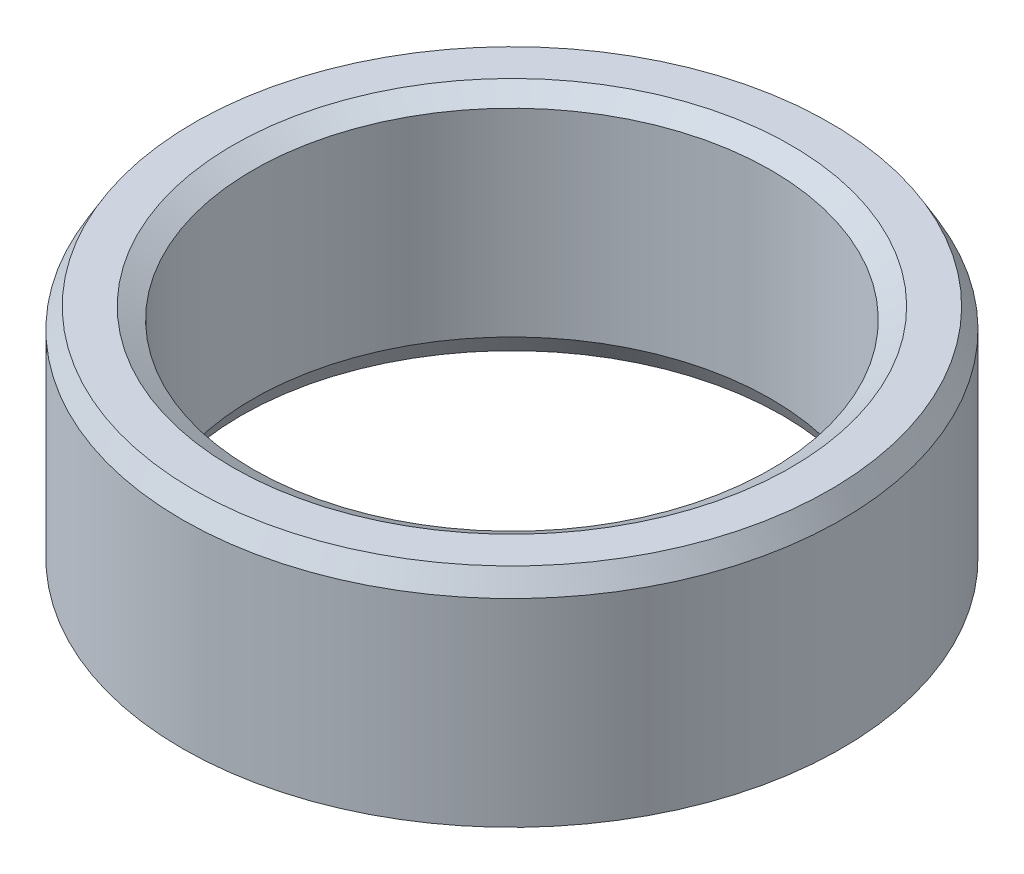
ISO-10303-21;
HEADER;
FILE_DESCRIPTION(('STEP AP214'),'2;1');
FILE_NAME('part.step','',(''),(''),'','','');
FILE_SCHEMA(('AUTOMOTIVE_DESIGN { 1 0 10303 214 1 1 1 1 }'));
ENDSEC;
DATA;
#1=APPLICATION_CONTEXT('core data for automotive mechanical design processes');
#2=APPLICATION_PROTOCOL_DEFINITION('international standard','automotive_design',2000,#1);
#3=PRODUCT_CONTEXT('',#1,'mechanical');
#4=PRODUCT('Part','Part','',(#3));
#5=PRODUCT_RELATED_PRODUCT_CATEGORY('part','',(#4));
#6=PRODUCT_DEFINITION_FORMATION('','',#4);
#7=PRODUCT_DEFINITION_CONTEXT('part definition',#1,'design');
#8=PRODUCT_DEFINITION('design','',#6,#7);
#9=PRODUCT_DEFINITION_SHAPE('','',#8);
#10=(LENGTH_UNIT() NAMED_UNIT(*) SI_UNIT(.MILLI.,.METRE.));
#11=(NAMED_UNIT(*) PLANE_ANGLE_UNIT() SI_UNIT($,.RADIAN.));
#12=(NAMED_UNIT(*) SI_UNIT($,.STERADIAN.) SOLID_ANGLE_UNIT());
#13=UNCERTAINTY_MEASURE_WITH_UNIT(LENGTH_MEASURE(1.E-05),#10,'distance_accuracy_value','');
#14=(GEOMETRIC_REPRESENTATION_CONTEXT(3) GLOBAL_UNCERTAINTY_ASSIGNED_CONTEXT((#13)) GLOBAL_UNIT_ASSIGNED_CONTEXT((#10,
#11,#12)) REPRESENTATION_CONTEXT('',''));
#15=CARTESIAN_POINT('',(0.,0.,0.));
#16=DIRECTION('',(0.,0.,1.));
#17=DIRECTION('',(1.,0.,0.));
#18=AXIS2_PLACEMENT_3D('',#15,#16,#17);
#19=CARTESIAN_POINT('',(0.,24.4000083490833,0.));
#20=DIRECTION('',(0.,-1.,0.));
#21=DIRECTION('',(0.,0.,-1.));
#22=AXIS2_PLACEMENT_3D('',#19,#20,#21);
#23=CYLINDRICAL_SURFACE('',#22,35.);
#24=CARTESIAN_POINT('',(0.,1.22980136216013,0.));
#25=DIRECTION('',(0.,1.,0.));
#26=DIRECTION('',(0.,0.,1.));
#27=AXIS2_PLACEMENT_3D('',#24,#25,#26);
#28=CIRCLE('',#27,35.);
#29=CARTESIAN_POINT('',(0.,1.22980136216013,35.));
#30=VERTEX_POINT('',#29);
#31=EDGE_CURVE('E10',#30,#30,#28,.T.);
#32=ORIENTED_EDGE('',*,*,#31,.T.);
#33=EDGE_LOOP('',(#32));
#34=FACE_BOUND('',#33,.T.);
#35=CARTESIAN_POINT('',(0.,22.2699299066045,0.));
#36=DIRECTION('',(0.,1.,0.));
#37=DIRECTION('',(0.,0.,1.));
#38=AXIS2_PLACEMENT_3D('',#35,#36,#37);
#39=CIRCLE('',#38,35.);
#40=CARTESIAN_POINT('',(0.,22.2699299066045,35.));
#41=VERTEX_POINT('',#40);
#42=EDGE_CURVE('E50',#41,#41,#39,.F.);
#43=ORIENTED_EDGE('',*,*,#42,.T.);
#44=EDGE_LOOP('',(#43));
#45=FACE_BOUND('',#44,.T.);
#46=ADVANCED_FACE('F39',(#34,#45),#23,.T.);
#47=CARTESIAN_POINT('',(0.,24.4000083490833,0.));
#48=DIRECTION('',(0.,1.,0.));
#49=DIRECTION('',(0.,0.,1.));
#50=AXIS2_PLACEMENT_3D('',#47,#48,#49);
#51=PLANE('',#50);
#52=CARTESIAN_POINT('',(0.,24.4000083490833,0.));
#53=DIRECTION('',(0.,1.,0.));
#54=DIRECTION('',(0.,0.,1.));
#55=AXIS2_PLACEMENT_3D('',#52,#53,#54);
#56=CIRCLE('',#55,29.6420088446236);
#57=CARTESIAN_POINT('',(0.,24.4000083490833,29.6420088446236));
#58=VERTEX_POINT('',#57);
#59=EDGE_CURVE('E58',#58,#58,#56,.F.);
#60=ORIENTED_EDGE('',*,*,#59,.T.);
#61=EDGE_LOOP('',(#60));
#62=FACE_BOUND('',#61,.T.);
#63=CARTESIAN_POINT('',(0.,24.4000083490833,0.));
#64=DIRECTION('',(0.,1.,0.));
#65=DIRECTION('',(0.,0.,1.));
#66=AXIS2_PLACEMENT_3D('',#63,#64,#65);
#67=CIRCLE('',#66,33.7701986378399);
#68=CARTESIAN_POINT('',(0.,24.4000083490833,33.7701986378399));
#69=VERTEX_POINT('',#68);
#70=EDGE_CURVE('E61',#69,#69,#67,.T.);
#71=ORIENTED_EDGE('',*,*,#70,.T.);
#72=EDGE_LOOP('',(#71));
#73=FACE_BOUND('',#72,.T.);
#74=ADVANCED_FACE('F88',(#62,#73),#51,.T.);
#75=CARTESIAN_POINT('',(0.,0.,0.));
#76=DIRECTION('',(0.,1.,0.));
#77=DIRECTION('',(0.,0.,1.));
#78=AXIS2_PLACEMENT_3D('',#75,#76,#77);
#79=PLANE('',#78);
#80=CARTESIAN_POINT('',(0.,0.,0.));
#81=DIRECTION('',(0.,1.,0.));
#82=DIRECTION('',(0.,0.,1.));
#83=AXIS2_PLACEMENT_3D('',#80,#81,#82);
#84=CIRCLE('',#83,28.7417317643049);
#85=CARTESIAN_POINT('',(0.,0.,28.7417317643049));
#86=VERTEX_POINT('',#85);
#87=EDGE_CURVE('E51',#86,#86,#84,.T.);
#88=ORIENTED_EDGE('',*,*,#87,.T.);
#89=EDGE_LOOP('',(#88));
#90=FACE_BOUND('',#89,.T.);
#91=CARTESIAN_POINT('',(0.,0.,0.));
#92=DIRECTION('',(0.,1.,0.));
#93=DIRECTION('',(0.,0.,1.));
#94=AXIS2_PLACEMENT_3D('',#91,#92,#93);
#95=CIRCLE('',#94,32.8699215575212);
#96=CARTESIAN_POINT('',(0.,0.,32.8699215575212));
#97=VERTEX_POINT('',#96);
#98=EDGE_CURVE('E54',#97,#97,#95,.F.);
#99=ORIENTED_EDGE('',*,*,#98,.T.);
#100=EDGE_LOOP('',(#99));
#101=FACE_BOUND('',#100,.T.);
#102=ADVANCED_FACE('F83',(#90,#101),#79,.F.);
#103=CARTESIAN_POINT('',(0.,24.4000083490833,0.));
#104=DIRECTION('',(0.,-1.,0.));
#105=DIRECTION('',(0.,0.,-1.));
#106=AXIS2_PLACEMENT_3D('',#103,#104,#105);
#107=CYLINDRICAL_SURFACE('',#106,27.5119304021448);
#108=CARTESIAN_POINT('',(0.,23.1702069869232,0.));
#109=DIRECTION('',(0.,1.,0.));
#110=DIRECTION('',(0.,0.,1.));
#111=AXIS2_PLACEMENT_3D('',#108,#109,#110);
#112=CIRCLE('',#111,27.5119304021448);
#113=CARTESIAN_POINT('',(0.,23.1702069869232,27.5119304021448));
#114=VERTEX_POINT('',#113);
#115=EDGE_CURVE('E67',#114,#114,#112,.T.);
#116=ORIENTED_EDGE('',*,*,#115,.T.);
#117=EDGE_LOOP('',(#116));
#118=FACE_BOUND('',#117,.T.);
#119=CARTESIAN_POINT('',(0.,2.13007844247876,0.));
#120=DIRECTION('',(0.,1.,0.));
#121=DIRECTION('',(0.,0.,1.));
#122=AXIS2_PLACEMENT_3D('',#119,#120,#121);
#123=CIRCLE('',#122,27.5119304021448);
#124=CARTESIAN_POINT('',(0.,2.13007844247876,27.5119304021448));
#125=VERTEX_POINT('',#124);
#126=EDGE_CURVE('E69',#125,#125,#123,.F.);
#127=ORIENTED_EDGE('',*,*,#126,.T.);
#128=EDGE_LOOP('',(#127));
#129=FACE_BOUND('',#128,.T.);
#130=ADVANCED_FACE('F71',(#118,#129),#107,.F.);
#131=CARTESIAN_POINT('',(0.,23.1702069869232,0.));
#132=DIRECTION('',(0.,1.,0.));
#133=DIRECTION('',(0.,0.,1.));
#134=AXIS2_PLACEMENT_3D('',#131,#132,#133);
#135=CONICAL_SURFACE('',#134,27.5119304021448,1.0471975511966);
#136=ORIENTED_EDGE('',*,*,#59,.F.);
#137=EDGE_LOOP('',(#136));
#138=FACE_BOUND('',#137,.T.);
#139=ORIENTED_EDGE('',*,*,#115,.F.);
#140=EDGE_LOOP('',(#139));
#141=FACE_BOUND('',#140,.T.);
#142=ADVANCED_FACE('F77',(#138,#141),#135,.F.);
#143=CARTESIAN_POINT('',(0.,0.,0.));
#144=DIRECTION('',(0.,-1.,0.));
#145=DIRECTION('',(0.,0.,-1.));
#146=AXIS2_PLACEMENT_3D('',#143,#144,#145);
#147=CONICAL_SURFACE('',#146,28.7417317643049,0.523598775598296);
#148=ORIENTED_EDGE('',*,*,#126,.F.);
#149=EDGE_LOOP('',(#148));
#150=FACE_BOUND('',#149,.T.);
#151=ORIENTED_EDGE('',*,*,#87,.F.);
#152=EDGE_LOOP('',(#151));
#153=FACE_BOUND('',#152,.T.);
#154=ADVANCED_FACE('F73',(#150,#153),#147,.F.);
#155=CARTESIAN_POINT('',(0.,1.22980136216013,0.));
#156=DIRECTION('',(0.,1.,0.));
#157=DIRECTION('',(0.,0.,1.));
#158=AXIS2_PLACEMENT_3D('',#155,#156,#157);
#159=CONICAL_SURFACE('',#158,35.,1.0471975511966);
#160=ORIENTED_EDGE('',*,*,#98,.F.);
#161=EDGE_LOOP('',(#160));
#162=FACE_BOUND('',#161,.T.);
#163=ORIENTED_EDGE('',*,*,#31,.F.);
#164=EDGE_LOOP('',(#163));
#165=FACE_BOUND('',#164,.T.);
#166=ADVANCED_FACE('F76',(#162,#165),#159,.T.);
#167=CARTESIAN_POINT('',(0.,24.4000083490833,0.));
#168=DIRECTION('',(0.,-1.,0.));
#169=DIRECTION('',(0.,0.,-1.));
#170=AXIS2_PLACEMENT_3D('',#167,#168,#169);
#171=CONICAL_SURFACE('',#170,33.7701986378399,0.523598775598292);
#172=ORIENTED_EDGE('',*,*,#42,.F.);
#173=EDGE_LOOP('',(#172));
#174=FACE_BOUND('',#173,.T.);
#175=ORIENTED_EDGE('',*,*,#70,.F.);
#176=EDGE_LOOP('',(#175));
#177=FACE_BOUND('',#176,.T.);
#178=ADVANCED_FACE('F45',(#174,#177),#171,.T.);
#179=CLOSED_SHELL('',(#46,#74,#102,#130,#142,#154,#166,#178));
#180=MANIFOLD_SOLID_BREP('B2',#179);
#181=ADVANCED_BREP_SHAPE_REPRESENTATION('',(#18,#180),#14);
#182=SHAPE_DEFINITION_REPRESENTATION(#9,#181);
ENDSEC;
END-ISO-10303-21;
